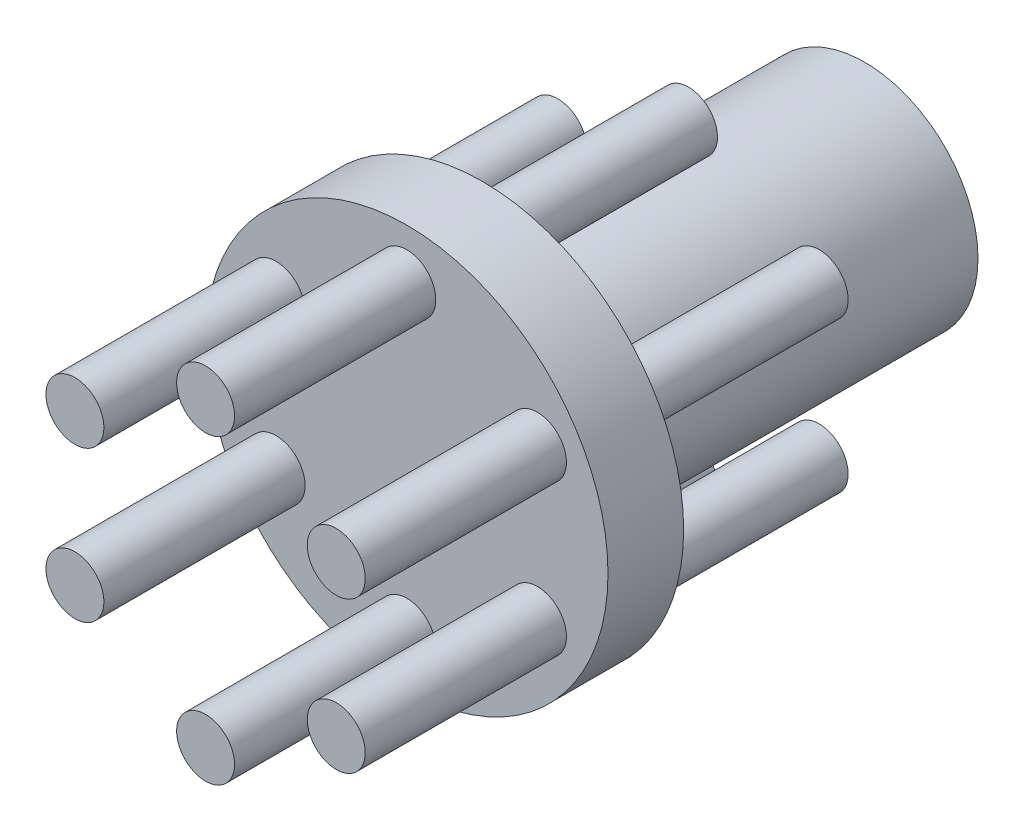
ISO-10303-21;
HEADER;
FILE_DESCRIPTION(('STEP AP214'),'2;1');
FILE_NAME('part.step','',(''),(''),'','','');
FILE_SCHEMA(('AUTOMOTIVE_DESIGN { 1 0 10303 214 1 1 1 1 }'));
ENDSEC;
DATA;
#1=APPLICATION_CONTEXT('core data for automotive mechanical design processes');
#2=APPLICATION_PROTOCOL_DEFINITION('international standard','automotive_design',2000,#1);
#3=PRODUCT_CONTEXT('',#1,'mechanical');
#4=PRODUCT('Part','Part','',(#3));
#5=PRODUCT_RELATED_PRODUCT_CATEGORY('part','',(#4));
#6=PRODUCT_DEFINITION_FORMATION('','',#4);
#7=PRODUCT_DEFINITION_CONTEXT('part definition',#1,'design');
#8=PRODUCT_DEFINITION('design','',#6,#7);
#9=PRODUCT_DEFINITION_SHAPE('','',#8);
#10=(LENGTH_UNIT() NAMED_UNIT(*) SI_UNIT(.MILLI.,.METRE.));
#11=(NAMED_UNIT(*) PLANE_ANGLE_UNIT() SI_UNIT($,.RADIAN.));
#12=(NAMED_UNIT(*) SI_UNIT($,.STERADIAN.) SOLID_ANGLE_UNIT());
#13=UNCERTAINTY_MEASURE_WITH_UNIT(LENGTH_MEASURE(1.E-05),#10,'distance_accuracy_value','');
#14=(GEOMETRIC_REPRESENTATION_CONTEXT(3) GLOBAL_UNCERTAINTY_ASSIGNED_CONTEXT((#13)) GLOBAL_UNIT_ASSIGNED_CONTEXT((#10,
#11,#12)) REPRESENTATION_CONTEXT('',''));
#15=CARTESIAN_POINT('',(0.,0.,0.));
#16=DIRECTION('',(0.,0.,1.));
#17=DIRECTION('',(1.,0.,0.));
#18=AXIS2_PLACEMENT_3D('',#15,#16,#17);
#19=CARTESIAN_POINT('',(0.,0.,0.));
#20=DIRECTION('',(0.,0.,1.));
#21=DIRECTION('',(1.,0.,0.));
#22=AXIS2_PLACEMENT_3D('',#19,#20,#21);
#23=PLANE('',#22);
#24=CARTESIAN_POINT('',(-8.24889197104655,4.76249999999958,0.));
#25=DIRECTION('',(0.,0.,1.));
#26=DIRECTION('',(1.,0.,0.));
#27=AXIS2_PLACEMENT_3D('',#24,#25,#26);
#28=CIRCLE('',#27,1.8288);
#29=CARTESIAN_POINT('',(-6.42009197104655,4.76249999999958,0.));
#30=VERTEX_POINT('',#29);
#31=EDGE_CURVE('E113',#30,#30,#28,.T.);
#32=ORIENTED_EDGE('',*,*,#31,.T.);
#33=EDGE_LOOP('',(#32));
#34=FACE_BOUND('',#33,.T.);
#35=CARTESIAN_POINT('',(-8.24889197104607,-4.76250000000041,0.));
#36=DIRECTION('',(0.,0.,1.));
#37=DIRECTION('',(1.,0.,0.));
#38=AXIS2_PLACEMENT_3D('',#35,#36,#37);
#39=CIRCLE('',#38,1.8288);
#40=CARTESIAN_POINT('',(-6.42009197104607,-4.76250000000041,0.));
#41=VERTEX_POINT('',#40);
#42=EDGE_CURVE('E104',#41,#41,#39,.T.);
#43=ORIENTED_EDGE('',*,*,#42,.T.);
#44=EDGE_LOOP('',(#43));
#45=FACE_BOUND('',#44,.T.);
#46=CARTESIAN_POINT('',(9.44592547945624E-13,-9.525,0.));
#47=DIRECTION('',(0.,0.,1.));
#48=DIRECTION('',(1.,0.,0.));
#49=AXIS2_PLACEMENT_3D('',#46,#47,#48);
#50=CIRCLE('',#49,1.8288);
#51=CARTESIAN_POINT('',(1.82880000000094,-9.525,0.));
#52=VERTEX_POINT('',#51);
#53=EDGE_CURVE('E95',#52,#52,#50,.T.);
#54=ORIENTED_EDGE('',*,*,#53,.T.);
#55=EDGE_LOOP('',(#54));
#56=FACE_BOUND('',#55,.T.);
#57=CARTESIAN_POINT('',(8.24889197104749,-4.76249999999959,0.));
#58=DIRECTION('',(0.,0.,1.));
#59=DIRECTION('',(1.,0.,0.));
#60=AXIS2_PLACEMENT_3D('',#57,#58,#59);
#61=CIRCLE('',#60,1.8288);
#62=CARTESIAN_POINT('',(10.0776919710475,-4.76249999999959,0.));
#63=VERTEX_POINT('',#62);
#64=EDGE_CURVE('E86',#63,#63,#61,.T.);
#65=ORIENTED_EDGE('',*,*,#64,.T.);
#66=EDGE_LOOP('',(#65));
#67=FACE_BOUND('',#66,.T.);
#68=CARTESIAN_POINT('',(8.24889197104701,4.76250000000041,0.));
#69=DIRECTION('',(0.,0.,1.));
#70=DIRECTION('',(1.,0.,0.));
#71=AXIS2_PLACEMENT_3D('',#68,#69,#70);
#72=CIRCLE('',#71,1.8288);
#73=CARTESIAN_POINT('',(10.077691971047,4.76250000000041,0.));
#74=VERTEX_POINT('',#73);
#75=EDGE_CURVE('E77',#74,#74,#72,.T.);
#76=ORIENTED_EDGE('',*,*,#75,.T.);
#77=EDGE_LOOP('',(#76));
#78=FACE_BOUND('',#77,.T.);
#79=CARTESIAN_POINT('',(0.,9.525,0.));
#80=DIRECTION('',(0.,0.,1.));
#81=DIRECTION('',(1.,0.,0.));
#82=AXIS2_PLACEMENT_3D('',#79,#80,#81);
#83=CIRCLE('',#82,1.8288);
#84=CARTESIAN_POINT('',(1.8288,9.525,0.));
#85=VERTEX_POINT('',#84);
#86=EDGE_CURVE('E68',#85,#85,#83,.T.);
#87=ORIENTED_EDGE('',*,*,#86,.T.);
#88=EDGE_LOOP('',(#87));
#89=FACE_BOUND('',#88,.T.);
#90=CARTESIAN_POINT('',(0.,0.,0.));
#91=DIRECTION('',(0.,0.,1.));
#92=DIRECTION('',(1.,0.,0.));
#93=AXIS2_PLACEMENT_3D('',#90,#91,#92);
#94=CIRCLE('',#93,12.7);
#95=CARTESIAN_POINT('',(12.7,0.,0.));
#96=VERTEX_POINT('',#95);
#97=EDGE_CURVE('E60',#96,#96,#94,.T.);
#98=ORIENTED_EDGE('',*,*,#97,.F.);
#99=EDGE_LOOP('',(#98));
#100=FACE_BOUND('',#99,.T.);
#101=CARTESIAN_POINT('',(0.,0.,0.));
#102=DIRECTION('',(0.,0.,1.));
#103=DIRECTION('',(1.,0.,0.));
#104=AXIS2_PLACEMENT_3D('',#101,#102,#103);
#105=CIRCLE('',#104,7.1501);
#106=CARTESIAN_POINT('',(7.1501,0.,0.));
#107=VERTEX_POINT('',#106);
#108=EDGE_CURVE('E56',#107,#107,#105,.F.);
#109=ORIENTED_EDGE('',*,*,#108,.F.);
#110=EDGE_LOOP('',(#109));
#111=FACE_BOUND('',#110,.T.);
#112=ADVANCED_FACE('F30',(#34,#45,#56,#67,#78,#89,#100,#111),#23,.F.);
#113=CARTESIAN_POINT('',(0.,0.,4.7752));
#114=DIRECTION('',(0.,0.,-1.));
#115=DIRECTION('',(-1.,0.,0.));
#116=AXIS2_PLACEMENT_3D('',#113,#114,#115);
#117=CYLINDRICAL_SURFACE('',#116,12.7);
#118=CARTESIAN_POINT('',(0.,0.,4.7752));
#119=DIRECTION('',(0.,0.,1.));
#120=DIRECTION('',(1.,0.,0.));
#121=AXIS2_PLACEMENT_3D('',#118,#119,#120);
#122=CIRCLE('',#121,12.7);
#123=CARTESIAN_POINT('',(12.7,0.,4.7752));
#124=VERTEX_POINT('',#123);
#125=EDGE_CURVE('E59',#124,#124,#122,.T.);
#126=ORIENTED_EDGE('',*,*,#125,.F.);
#127=EDGE_LOOP('',(#126));
#128=FACE_BOUND('',#127,.T.);
#129=ORIENTED_EDGE('',*,*,#97,.T.);
#130=EDGE_LOOP('',(#129));
#131=FACE_BOUND('',#130,.T.);
#132=ADVANCED_FACE('F32',(#128,#131),#117,.T.);
#133=CARTESIAN_POINT('',(0.,0.,4.7752));
#134=DIRECTION('',(0.,0.,1.));
#135=DIRECTION('',(1.,0.,0.));
#136=AXIS2_PLACEMENT_3D('',#133,#134,#135);
#137=PLANE('',#136);
#138=CARTESIAN_POINT('',(-8.24889197104655,4.76249999999958,4.7752));
#139=DIRECTION('',(0.,0.,1.));
#140=DIRECTION('',(1.,0.,0.));
#141=AXIS2_PLACEMENT_3D('',#138,#139,#140);
#142=CIRCLE('',#141,1.8288);
#143=CARTESIAN_POINT('',(-6.42009197104655,4.76249999999958,4.7752));
#144=VERTEX_POINT('',#143);
#145=EDGE_CURVE('E10',#144,#144,#142,.T.);
#146=ORIENTED_EDGE('',*,*,#145,.F.);
#147=EDGE_LOOP('',(#146));
#148=FACE_BOUND('',#147,.T.);
#149=CARTESIAN_POINT('',(-8.24889197104607,-4.76250000000041,4.7752));
#150=DIRECTION('',(0.,0.,1.));
#151=DIRECTION('',(1.,0.,0.));
#152=AXIS2_PLACEMENT_3D('',#149,#150,#151);
#153=CIRCLE('',#152,1.8288);
#154=CARTESIAN_POINT('',(-6.42009197104607,-4.76250000000041,4.7752));
#155=VERTEX_POINT('',#154);
#156=EDGE_CURVE('E37',#155,#155,#153,.T.);
#157=ORIENTED_EDGE('',*,*,#156,.F.);
#158=EDGE_LOOP('',(#157));
#159=FACE_BOUND('',#158,.T.);
#160=CARTESIAN_POINT('',(9.44592547945624E-13,-9.525,4.7752));
#161=DIRECTION('',(0.,0.,1.));
#162=DIRECTION('',(1.,0.,0.));
#163=AXIS2_PLACEMENT_3D('',#160,#161,#162);
#164=CIRCLE('',#163,1.8288);
#165=CARTESIAN_POINT('',(1.82880000000094,-9.525,4.7752));
#166=VERTEX_POINT('',#165);
#167=EDGE_CURVE('E41',#166,#166,#164,.T.);
#168=ORIENTED_EDGE('',*,*,#167,.F.);
#169=EDGE_LOOP('',(#168));
#170=FACE_BOUND('',#169,.T.);
#171=CARTESIAN_POINT('',(8.24889197104749,-4.76249999999959,4.7752));
#172=DIRECTION('',(0.,0.,1.));
#173=DIRECTION('',(1.,0.,0.));
#174=AXIS2_PLACEMENT_3D('',#171,#172,#173);
#175=CIRCLE('',#174,1.8288);
#176=CARTESIAN_POINT('',(10.0776919710475,-4.76249999999959,4.7752));
#177=VERTEX_POINT('',#176);
#178=EDGE_CURVE('E45',#177,#177,#175,.T.);
#179=ORIENTED_EDGE('',*,*,#178,.F.);
#180=EDGE_LOOP('',(#179));
#181=FACE_BOUND('',#180,.T.);
#182=CARTESIAN_POINT('',(8.24889197104701,4.76250000000041,4.7752));
#183=DIRECTION('',(0.,0.,1.));
#184=DIRECTION('',(1.,0.,0.));
#185=AXIS2_PLACEMENT_3D('',#182,#183,#184);
#186=CIRCLE('',#185,1.8288);
#187=CARTESIAN_POINT('',(10.077691971047,4.76250000000041,4.7752));
#188=VERTEX_POINT('',#187);
#189=EDGE_CURVE('E50',#188,#188,#186,.T.);
#190=ORIENTED_EDGE('',*,*,#189,.F.);
#191=EDGE_LOOP('',(#190));
#192=FACE_BOUND('',#191,.T.);
#193=CARTESIAN_POINT('',(0.,9.525,4.7752));
#194=DIRECTION('',(0.,0.,1.));
#195=DIRECTION('',(1.,0.,0.));
#196=AXIS2_PLACEMENT_3D('',#193,#194,#195);
#197=CIRCLE('',#196,1.8288);
#198=CARTESIAN_POINT('',(1.8288,9.525,4.7752));
#199=VERTEX_POINT('',#198);
#200=EDGE_CURVE('E53',#199,#199,#197,.T.);
#201=ORIENTED_EDGE('',*,*,#200,.F.);
#202=EDGE_LOOP('',(#201));
#203=FACE_BOUND('',#202,.T.);
#204=ORIENTED_EDGE('',*,*,#125,.T.);
#205=EDGE_LOOP('',(#204));
#206=FACE_BOUND('',#205,.T.);
#207=ADVANCED_FACE('F144',(#148,#159,#170,#181,#192,#203,#206),#137,.T.);
#208=CARTESIAN_POINT('',(0.,0.,-24.13));
#209=DIRECTION('',(0.,0.,1.));
#210=DIRECTION('',(1.,0.,0.));
#211=AXIS2_PLACEMENT_3D('',#208,#209,#210);
#212=CYLINDRICAL_SURFACE('',#211,7.1501);
#213=CARTESIAN_POINT('',(0.,0.,-24.13));
#214=DIRECTION('',(0.,0.,-1.));
#215=DIRECTION('',(-1.,0.,0.));
#216=AXIS2_PLACEMENT_3D('',#213,#214,#215);
#217=CIRCLE('',#216,7.1501);
#218=CARTESIAN_POINT('',(-7.1501,0.,-24.13));
#219=VERTEX_POINT('',#218);
#220=EDGE_CURVE('E63',#219,#219,#217,.T.);
#221=ORIENTED_EDGE('',*,*,#220,.F.);
#222=EDGE_LOOP('',(#221));
#223=FACE_BOUND('',#222,.T.);
#224=ORIENTED_EDGE('',*,*,#108,.T.);
#225=EDGE_LOOP('',(#224));
#226=FACE_BOUND('',#225,.T.);
#227=ADVANCED_FACE('F150',(#223,#226),#212,.T.);
#228=CARTESIAN_POINT('',(0.,0.,-24.13));
#229=DIRECTION('',(0.,0.,-1.));
#230=DIRECTION('',(-1.,0.,0.));
#231=AXIS2_PLACEMENT_3D('',#228,#229,#230);
#232=PLANE('',#231);
#233=ORIENTED_EDGE('',*,*,#220,.T.);
#234=EDGE_LOOP('',(#233));
#235=FACE_BOUND('',#234,.T.);
#236=ADVANCED_FACE('F154',(#235),#232,.T.);
#237=CARTESIAN_POINT('',(0.,9.525,17.4752));
#238=DIRECTION('',(0.,0.,1.));
#239=DIRECTION('',(1.,0.,0.));
#240=AXIS2_PLACEMENT_3D('',#237,#238,#239);
#241=PLANE('',#240);
#242=CARTESIAN_POINT('',(0.,9.525,17.4752));
#243=DIRECTION('',(0.,0.,1.));
#244=DIRECTION('',(1.,0.,0.));
#245=AXIS2_PLACEMENT_3D('',#242,#243,#244);
#246=CIRCLE('',#245,1.8288);
#247=CARTESIAN_POINT('',(1.8288,9.525,17.4752));
#248=VERTEX_POINT('',#247);
#249=EDGE_CURVE('E74',#248,#248,#246,.T.);
#250=ORIENTED_EDGE('',*,*,#249,.T.);
#251=EDGE_LOOP('',(#250));
#252=FACE_BOUND('',#251,.T.);
#253=ADVANCED_FACE('F158',(#252),#241,.T.);
#254=CARTESIAN_POINT('',(0.,9.525,-13.0048));
#255=DIRECTION('',(0.,0.,1.));
#256=DIRECTION('',(1.,0.,0.));
#257=AXIS2_PLACEMENT_3D('',#254,#255,#256);
#258=CYLINDRICAL_SURFACE('',#257,1.8288);
#259=ORIENTED_EDGE('',*,*,#200,.T.);
#260=EDGE_LOOP('',(#259));
#261=FACE_BOUND('',#260,.T.);
#262=ORIENTED_EDGE('',*,*,#249,.F.);
#263=EDGE_LOOP('',(#262));
#264=FACE_BOUND('',#263,.T.);
#265=ADVANCED_FACE('F160',(#261,#264),#258,.T.);
#266=CARTESIAN_POINT('',(0.,9.525,-13.0048));
#267=DIRECTION('',(0.,0.,1.));
#268=DIRECTION('',(1.,0.,0.));
#269=AXIS2_PLACEMENT_3D('',#266,#267,#268);
#270=CIRCLE('',#269,1.8288);
#271=CARTESIAN_POINT('',(1.8288,9.525,-13.0048));
#272=VERTEX_POINT('',#271);
#273=EDGE_CURVE('E71',#272,#272,#270,.T.);
#274=ORIENTED_EDGE('',*,*,#273,.T.);
#275=EDGE_LOOP('',(#274));
#276=FACE_BOUND('',#275,.T.);
#277=ORIENTED_EDGE('',*,*,#86,.F.);
#278=EDGE_LOOP('',(#277));
#279=FACE_BOUND('',#278,.T.);
#280=ADVANCED_FACE('F163',(#276,#279),#258,.T.);
#281=CARTESIAN_POINT('',(0.,9.525,-13.0048));
#282=DIRECTION('',(0.,0.,1.));
#283=DIRECTION('',(1.,0.,0.));
#284=AXIS2_PLACEMENT_3D('',#281,#282,#283);
#285=PLANE('',#284);
#286=ORIENTED_EDGE('',*,*,#273,.F.);
#287=EDGE_LOOP('',(#286));
#288=FACE_BOUND('',#287,.T.);
#289=ADVANCED_FACE('F165',(#288),#285,.F.);
#290=CARTESIAN_POINT('',(8.24889197104701,4.76250000000041,17.4752));
#291=DIRECTION('',(0.,0.,1.));
#292=DIRECTION('',(1.,0.,0.));
#293=AXIS2_PLACEMENT_3D('',#290,#291,#292);
#294=PLANE('',#293);
#295=CARTESIAN_POINT('',(8.24889197104701,4.76250000000041,17.4752));
#296=DIRECTION('',(0.,0.,1.));
#297=DIRECTION('',(1.,0.,0.));
#298=AXIS2_PLACEMENT_3D('',#295,#296,#297);
#299=CIRCLE('',#298,1.8288);
#300=CARTESIAN_POINT('',(10.077691971047,4.76250000000041,17.4752));
#301=VERTEX_POINT('',#300);
#302=EDGE_CURVE('E83',#301,#301,#299,.T.);
#303=ORIENTED_EDGE('',*,*,#302,.T.);
#304=EDGE_LOOP('',(#303));
#305=FACE_BOUND('',#304,.T.);
#306=ADVANCED_FACE('F168',(#305),#294,.T.);
#307=CARTESIAN_POINT('',(8.24889197104701,4.76250000000041,-13.0048));
#308=DIRECTION('',(0.,0.,1.));
#309=DIRECTION('',(1.,0.,0.));
#310=AXIS2_PLACEMENT_3D('',#307,#308,#309);
#311=CYLINDRICAL_SURFACE('',#310,1.8288);
#312=ORIENTED_EDGE('',*,*,#189,.T.);
#313=EDGE_LOOP('',(#312));
#314=FACE_BOUND('',#313,.T.);
#315=ORIENTED_EDGE('',*,*,#302,.F.);
#316=EDGE_LOOP('',(#315));
#317=FACE_BOUND('',#316,.T.);
#318=ADVANCED_FACE('F173',(#314,#317),#311,.T.);
#319=CARTESIAN_POINT('',(8.24889197104701,4.76250000000041,-13.0048));
#320=DIRECTION('',(0.,0.,1.));
#321=DIRECTION('',(1.,0.,0.));
#322=AXIS2_PLACEMENT_3D('',#319,#320,#321);
#323=CIRCLE('',#322,1.8288);
#324=CARTESIAN_POINT('',(10.077691971047,4.76250000000041,-13.0048));
#325=VERTEX_POINT('',#324);
#326=EDGE_CURVE('E80',#325,#325,#323,.T.);
#327=ORIENTED_EDGE('',*,*,#326,.T.);
#328=EDGE_LOOP('',(#327));
#329=FACE_BOUND('',#328,.T.);
#330=ORIENTED_EDGE('',*,*,#75,.F.);
#331=EDGE_LOOP('',(#330));
#332=FACE_BOUND('',#331,.T.);
#333=ADVANCED_FACE('F176',(#329,#332),#311,.T.);
#334=CARTESIAN_POINT('',(8.24889197104701,4.76250000000041,-13.0048));
#335=DIRECTION('',(0.,0.,1.));
#336=DIRECTION('',(1.,0.,0.));
#337=AXIS2_PLACEMENT_3D('',#334,#335,#336);
#338=PLANE('',#337);
#339=ORIENTED_EDGE('',*,*,#326,.F.);
#340=EDGE_LOOP('',(#339));
#341=FACE_BOUND('',#340,.T.);
#342=ADVANCED_FACE('F178',(#341),#338,.F.);
#343=CARTESIAN_POINT('',(8.24889197104749,-4.76249999999959,17.4752));
#344=DIRECTION('',(0.,0.,1.));
#345=DIRECTION('',(1.,0.,0.));
#346=AXIS2_PLACEMENT_3D('',#343,#344,#345);
#347=PLANE('',#346);
#348=CARTESIAN_POINT('',(8.24889197104749,-4.76249999999959,17.4752));
#349=DIRECTION('',(0.,0.,1.));
#350=DIRECTION('',(1.,0.,0.));
#351=AXIS2_PLACEMENT_3D('',#348,#349,#350);
#352=CIRCLE('',#351,1.8288);
#353=CARTESIAN_POINT('',(10.0776919710475,-4.76249999999959,17.4752));
#354=VERTEX_POINT('',#353);
#355=EDGE_CURVE('E92',#354,#354,#352,.T.);
#356=ORIENTED_EDGE('',*,*,#355,.T.);
#357=EDGE_LOOP('',(#356));
#358=FACE_BOUND('',#357,.T.);
#359=ADVANCED_FACE('F181',(#358),#347,.T.);
#360=CARTESIAN_POINT('',(8.24889197104749,-4.76249999999959,-13.0048));
#361=DIRECTION('',(0.,0.,1.));
#362=DIRECTION('',(1.,0.,0.));
#363=AXIS2_PLACEMENT_3D('',#360,#361,#362);
#364=CYLINDRICAL_SURFACE('',#363,1.8288);
#365=ORIENTED_EDGE('',*,*,#178,.T.);
#366=EDGE_LOOP('',(#365));
#367=FACE_BOUND('',#366,.T.);
#368=ORIENTED_EDGE('',*,*,#355,.F.);
#369=EDGE_LOOP('',(#368));
#370=FACE_BOUND('',#369,.T.);
#371=ADVANCED_FACE('F186',(#367,#370),#364,.T.);
#372=CARTESIAN_POINT('',(8.24889197104749,-4.76249999999959,-13.0048));
#373=DIRECTION('',(0.,0.,1.));
#374=DIRECTION('',(1.,0.,0.));
#375=AXIS2_PLACEMENT_3D('',#372,#373,#374);
#376=CIRCLE('',#375,1.8288);
#377=CARTESIAN_POINT('',(10.0776919710475,-4.76249999999959,-13.0048));
#378=VERTEX_POINT('',#377);
#379=EDGE_CURVE('E89',#378,#378,#376,.T.);
#380=ORIENTED_EDGE('',*,*,#379,.T.);
#381=EDGE_LOOP('',(#380));
#382=FACE_BOUND('',#381,.T.);
#383=ORIENTED_EDGE('',*,*,#64,.F.);
#384=EDGE_LOOP('',(#383));
#385=FACE_BOUND('',#384,.T.);
#386=ADVANCED_FACE('F189',(#382,#385),#364,.T.);
#387=CARTESIAN_POINT('',(8.24889197104749,-4.76249999999959,-13.0048));
#388=DIRECTION('',(0.,0.,1.));
#389=DIRECTION('',(1.,0.,0.));
#390=AXIS2_PLACEMENT_3D('',#387,#388,#389);
#391=PLANE('',#390);
#392=ORIENTED_EDGE('',*,*,#379,.F.);
#393=EDGE_LOOP('',(#392));
#394=FACE_BOUND('',#393,.T.);
#395=ADVANCED_FACE('F191',(#394),#391,.F.);
#396=CARTESIAN_POINT('',(9.44592547945624E-13,-9.525,17.4752));
#397=DIRECTION('',(0.,0.,1.));
#398=DIRECTION('',(1.,0.,0.));
#399=AXIS2_PLACEMENT_3D('',#396,#397,#398);
#400=PLANE('',#399);
#401=CARTESIAN_POINT('',(9.44592547945624E-13,-9.525,17.4752));
#402=DIRECTION('',(0.,0.,1.));
#403=DIRECTION('',(1.,0.,0.));
#404=AXIS2_PLACEMENT_3D('',#401,#402,#403);
#405=CIRCLE('',#404,1.8288);
#406=CARTESIAN_POINT('',(1.82880000000094,-9.525,17.4752));
#407=VERTEX_POINT('',#406);
#408=EDGE_CURVE('E101',#407,#407,#405,.T.);
#409=ORIENTED_EDGE('',*,*,#408,.T.);
#410=EDGE_LOOP('',(#409));
#411=FACE_BOUND('',#410,.T.);
#412=ADVANCED_FACE('F194',(#411),#400,.T.);
#413=CARTESIAN_POINT('',(9.44592547945624E-13,-9.525,-13.0048));
#414=DIRECTION('',(0.,0.,1.));
#415=DIRECTION('',(1.,0.,0.));
#416=AXIS2_PLACEMENT_3D('',#413,#414,#415);
#417=CYLINDRICAL_SURFACE('',#416,1.8288);
#418=ORIENTED_EDGE('',*,*,#167,.T.);
#419=EDGE_LOOP('',(#418));
#420=FACE_BOUND('',#419,.T.);
#421=ORIENTED_EDGE('',*,*,#408,.F.);
#422=EDGE_LOOP('',(#421));
#423=FACE_BOUND('',#422,.T.);
#424=ADVANCED_FACE('F199',(#420,#423),#417,.T.);
#425=CARTESIAN_POINT('',(9.44592547945624E-13,-9.525,-13.0048));
#426=DIRECTION('',(0.,0.,1.));
#427=DIRECTION('',(1.,0.,0.));
#428=AXIS2_PLACEMENT_3D('',#425,#426,#427);
#429=CIRCLE('',#428,1.8288);
#430=CARTESIAN_POINT('',(1.82880000000094,-9.525,-13.0048));
#431=VERTEX_POINT('',#430);
#432=EDGE_CURVE('E98',#431,#431,#429,.T.);
#433=ORIENTED_EDGE('',*,*,#432,.T.);
#434=EDGE_LOOP('',(#433));
#435=FACE_BOUND('',#434,.T.);
#436=ORIENTED_EDGE('',*,*,#53,.F.);
#437=EDGE_LOOP('',(#436));
#438=FACE_BOUND('',#437,.T.);
#439=ADVANCED_FACE('F202',(#435,#438),#417,.T.);
#440=CARTESIAN_POINT('',(9.44592547945624E-13,-9.525,-13.0048));
#441=DIRECTION('',(0.,0.,1.));
#442=DIRECTION('',(1.,0.,0.));
#443=AXIS2_PLACEMENT_3D('',#440,#441,#442);
#444=PLANE('',#443);
#445=ORIENTED_EDGE('',*,*,#432,.F.);
#446=EDGE_LOOP('',(#445));
#447=FACE_BOUND('',#446,.T.);
#448=ADVANCED_FACE('F204',(#447),#444,.F.);
#449=CARTESIAN_POINT('',(-8.24889197104607,-4.76250000000041,17.4752));
#450=DIRECTION('',(0.,0.,1.));
#451=DIRECTION('',(1.,0.,0.));
#452=AXIS2_PLACEMENT_3D('',#449,#450,#451);
#453=PLANE('',#452);
#454=CARTESIAN_POINT('',(-8.24889197104607,-4.76250000000041,17.4752));
#455=DIRECTION('',(0.,0.,1.));
#456=DIRECTION('',(1.,0.,0.));
#457=AXIS2_PLACEMENT_3D('',#454,#455,#456);
#458=CIRCLE('',#457,1.8288);
#459=CARTESIAN_POINT('',(-6.42009197104607,-4.76250000000041,17.4752));
#460=VERTEX_POINT('',#459);
#461=EDGE_CURVE('E110',#460,#460,#458,.T.);
#462=ORIENTED_EDGE('',*,*,#461,.T.);
#463=EDGE_LOOP('',(#462));
#464=FACE_BOUND('',#463,.T.);
#465=ADVANCED_FACE('F207',(#464),#453,.T.);
#466=CARTESIAN_POINT('',(-8.24889197104607,-4.76250000000041,-13.0048));
#467=DIRECTION('',(0.,0.,1.));
#468=DIRECTION('',(1.,0.,0.));
#469=AXIS2_PLACEMENT_3D('',#466,#467,#468);
#470=CYLINDRICAL_SURFACE('',#469,1.8288);
#471=ORIENTED_EDGE('',*,*,#156,.T.);
#472=EDGE_LOOP('',(#471));
#473=FACE_BOUND('',#472,.T.);
#474=ORIENTED_EDGE('',*,*,#461,.F.);
#475=EDGE_LOOP('',(#474));
#476=FACE_BOUND('',#475,.T.);
#477=ADVANCED_FACE('F212',(#473,#476),#470,.T.);
#478=CARTESIAN_POINT('',(-8.24889197104607,-4.76250000000041,-13.0048));
#479=DIRECTION('',(0.,0.,1.));
#480=DIRECTION('',(1.,0.,0.));
#481=AXIS2_PLACEMENT_3D('',#478,#479,#480);
#482=CIRCLE('',#481,1.8288);
#483=CARTESIAN_POINT('',(-6.42009197104607,-4.76250000000041,-13.0048));
#484=VERTEX_POINT('',#483);
#485=EDGE_CURVE('E107',#484,#484,#482,.T.);
#486=ORIENTED_EDGE('',*,*,#485,.T.);
#487=EDGE_LOOP('',(#486));
#488=FACE_BOUND('',#487,.T.);
#489=ORIENTED_EDGE('',*,*,#42,.F.);
#490=EDGE_LOOP('',(#489));
#491=FACE_BOUND('',#490,.T.);
#492=ADVANCED_FACE('F215',(#488,#491),#470,.T.);
#493=CARTESIAN_POINT('',(-8.24889197104607,-4.76250000000041,-13.0048));
#494=DIRECTION('',(0.,0.,1.));
#495=DIRECTION('',(1.,0.,0.));
#496=AXIS2_PLACEMENT_3D('',#493,#494,#495);
#497=PLANE('',#496);
#498=ORIENTED_EDGE('',*,*,#485,.F.);
#499=EDGE_LOOP('',(#498));
#500=FACE_BOUND('',#499,.T.);
#501=ADVANCED_FACE('F135',(#500),#497,.F.);
#502=CARTESIAN_POINT('',(-8.24889197104655,4.76249999999958,17.4752));
#503=DIRECTION('',(0.,0.,1.));
#504=DIRECTION('',(1.,0.,0.));
#505=AXIS2_PLACEMENT_3D('',#502,#503,#504);
#506=PLANE('',#505);
#507=CARTESIAN_POINT('',(-8.24889197104655,4.76249999999958,17.4752));
#508=DIRECTION('',(0.,0.,1.));
#509=DIRECTION('',(1.,0.,0.));
#510=AXIS2_PLACEMENT_3D('',#507,#508,#509);
#511=CIRCLE('',#510,1.8288);
#512=CARTESIAN_POINT('',(-6.42009197104655,4.76249999999958,17.4752));
#513=VERTEX_POINT('',#512);
#514=EDGE_CURVE('E119',#513,#513,#511,.T.);
#515=ORIENTED_EDGE('',*,*,#514,.T.);
#516=EDGE_LOOP('',(#515));
#517=FACE_BOUND('',#516,.T.);
#518=ADVANCED_FACE('F123',(#517),#506,.T.);
#519=CARTESIAN_POINT('',(-8.24889197104655,4.76249999999958,-13.0048));
#520=DIRECTION('',(0.,0.,1.));
#521=DIRECTION('',(1.,0.,0.));
#522=AXIS2_PLACEMENT_3D('',#519,#520,#521);
#523=CYLINDRICAL_SURFACE('',#522,1.8288);
#524=ORIENTED_EDGE('',*,*,#145,.T.);
#525=EDGE_LOOP('',(#524));
#526=FACE_BOUND('',#525,.T.);
#527=ORIENTED_EDGE('',*,*,#514,.F.);
#528=EDGE_LOOP('',(#527));
#529=FACE_BOUND('',#528,.T.);
#530=ADVANCED_FACE('F125',(#526,#529),#523,.T.);
#531=CARTESIAN_POINT('',(-8.24889197104655,4.76249999999958,-13.0048));
#532=DIRECTION('',(0.,0.,1.));
#533=DIRECTION('',(1.,0.,0.));
#534=AXIS2_PLACEMENT_3D('',#531,#532,#533);
#535=CIRCLE('',#534,1.8288);
#536=CARTESIAN_POINT('',(-6.42009197104655,4.76249999999958,-13.0048));
#537=VERTEX_POINT('',#536);
#538=EDGE_CURVE('E116',#537,#537,#535,.T.);
#539=ORIENTED_EDGE('',*,*,#538,.T.);
#540=EDGE_LOOP('',(#539));
#541=FACE_BOUND('',#540,.T.);
#542=ORIENTED_EDGE('',*,*,#31,.F.);
#543=EDGE_LOOP('',(#542));
#544=FACE_BOUND('',#543,.T.);
#545=ADVANCED_FACE('F127',(#541,#544),#523,.T.);
#546=CARTESIAN_POINT('',(-8.24889197104655,4.76249999999958,-13.0048));
#547=DIRECTION('',(0.,0.,1.));
#548=DIRECTION('',(1.,0.,0.));
#549=AXIS2_PLACEMENT_3D('',#546,#547,#548);
#550=PLANE('',#549);
#551=ORIENTED_EDGE('',*,*,#538,.F.);
#552=EDGE_LOOP('',(#551));
#553=FACE_BOUND('',#552,.T.);
#554=ADVANCED_FACE('F133',(#553),#550,.F.);
#555=CLOSED_SHELL('',(#112,#132,#207,#227,#236,#253,#265,#280,#289,#306,#318,#333,#342,#359,
#371,#386,#395,#412,#424,#439,#448,#465,#477,#492,#501,#518,#530,#545,#554));
#556=MANIFOLD_SOLID_BREP('B2',#555);
#557=ADVANCED_BREP_SHAPE_REPRESENTATION('',(#18,#556),#14);
#558=SHAPE_DEFINITION_REPRESENTATION(#9,#557);
ENDSEC;
END-ISO-10303-21;
